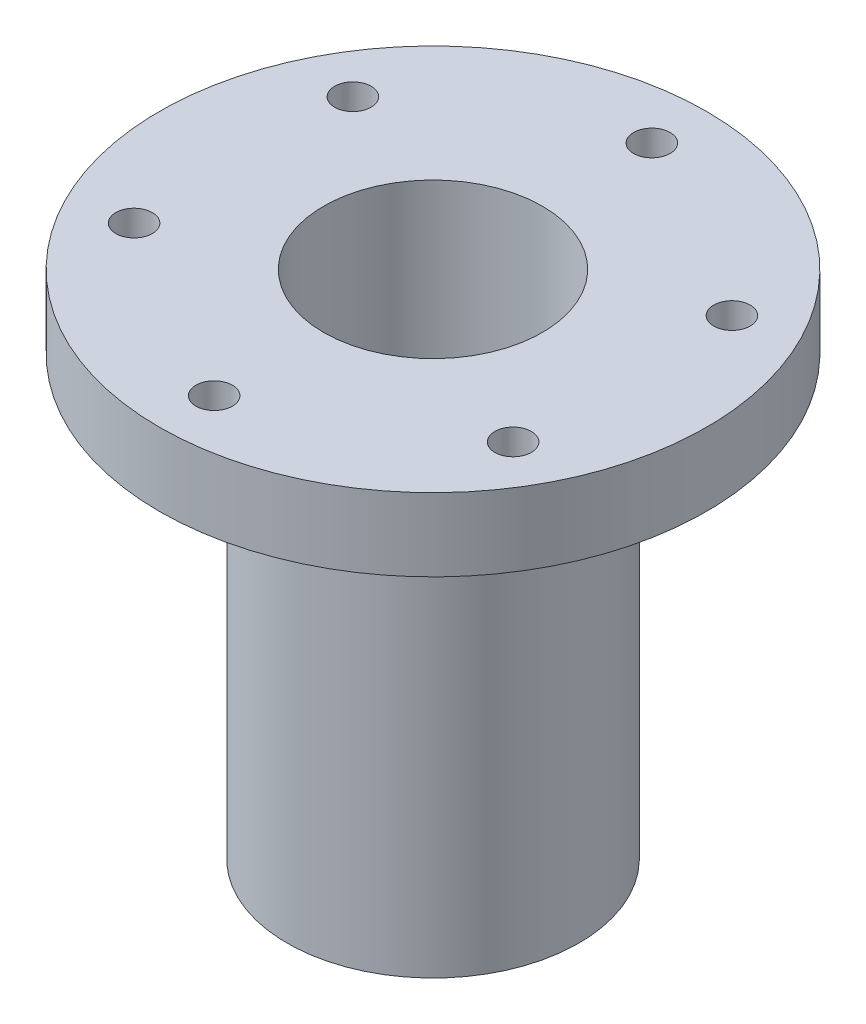
ISO-10303-21;
HEADER;
FILE_DESCRIPTION(('STEP AP214'),'2;1');
FILE_NAME('part.step','',(''),(''),'','','');
FILE_SCHEMA(('AUTOMOTIVE_DESIGN { 1 0 10303 214 1 1 1 1 }'));
ENDSEC;
DATA;
#1=APPLICATION_CONTEXT('core data for automotive mechanical design processes');
#2=APPLICATION_PROTOCOL_DEFINITION('international standard','automotive_design',2000,#1);
#3=PRODUCT_CONTEXT('',#1,'mechanical');
#4=PRODUCT('Part','Part','',(#3));
#5=PRODUCT_RELATED_PRODUCT_CATEGORY('part','',(#4));
#6=PRODUCT_DEFINITION_FORMATION('','',#4);
#7=PRODUCT_DEFINITION_CONTEXT('part definition',#1,'design');
#8=PRODUCT_DEFINITION('design','',#6,#7);
#9=PRODUCT_DEFINITION_SHAPE('','',#8);
#10=(LENGTH_UNIT() NAMED_UNIT(*) SI_UNIT(.MILLI.,.METRE.));
#11=(NAMED_UNIT(*) PLANE_ANGLE_UNIT() SI_UNIT($,.RADIAN.));
#12=(NAMED_UNIT(*) SI_UNIT($,.STERADIAN.) SOLID_ANGLE_UNIT());
#13=UNCERTAINTY_MEASURE_WITH_UNIT(LENGTH_MEASURE(1.E-05),#10,'distance_accuracy_value','');
#14=(GEOMETRIC_REPRESENTATION_CONTEXT(3) GLOBAL_UNCERTAINTY_ASSIGNED_CONTEXT((#13)) GLOBAL_UNIT_ASSIGNED_CONTEXT((#10,
#11,#12)) REPRESENTATION_CONTEXT('',''));
#15=CARTESIAN_POINT('',(0.,0.,0.));
#16=DIRECTION('',(0.,0.,1.));
#17=DIRECTION('',(1.,0.,0.));
#18=AXIS2_PLACEMENT_3D('',#15,#16,#17);
#19=CARTESIAN_POINT('',(-23.8125,6.90033333333332,0.));
#20=DIRECTION('',(0.,1.,0.));
#21=DIRECTION('',(0.,0.,1.));
#22=AXIS2_PLACEMENT_3D('',#19,#20,#21);
#23=PLANE('',#22);
#24=CARTESIAN_POINT('',(0.,6.90033333333332,-19.05));
#25=DIRECTION('',(0.,-1.,0.));
#26=DIRECTION('',(0.,0.,-1.));
#27=AXIS2_PLACEMENT_3D('',#24,#25,#26);
#28=CIRCLE('',#27,1.58749999999999);
#29=CARTESIAN_POINT('',(0.,6.90033333333332,-20.6375));
#30=VERTEX_POINT('',#29);
#31=EDGE_CURVE('E90',#30,#30,#28,.T.);
#32=ORIENTED_EDGE('',*,*,#31,.F.);
#33=EDGE_LOOP('',(#32));
#34=FACE_BOUND('',#33,.T.);
#35=CARTESIAN_POINT('',(-16.497783942094,6.90033333333332,-9.5250000000007));
#36=DIRECTION('',(0.,-1.,0.));
#37=DIRECTION('',(0.,0.,-1.));
#38=AXIS2_PLACEMENT_3D('',#35,#36,#37);
#39=CIRCLE('',#38,1.58749999999999);
#40=CARTESIAN_POINT('',(-16.497783942094,6.90033333333332,-11.1125000000007));
#41=VERTEX_POINT('',#40);
#42=EDGE_CURVE('E84',#41,#41,#39,.T.);
#43=ORIENTED_EDGE('',*,*,#42,.F.);
#44=EDGE_LOOP('',(#43));
#45=FACE_BOUND('',#44,.T.);
#46=CARTESIAN_POINT('',(-16.4977839420948,6.90033333333332,9.5249999999993));
#47=DIRECTION('',(0.,-1.,0.));
#48=DIRECTION('',(0.,0.,-1.));
#49=AXIS2_PLACEMENT_3D('',#46,#47,#48);
#50=CIRCLE('',#49,1.58749999999999);
#51=CARTESIAN_POINT('',(-16.4977839420948,6.90033333333332,7.93749999999931));
#52=VERTEX_POINT('',#51);
#53=EDGE_CURVE('E78',#52,#52,#50,.T.);
#54=ORIENTED_EDGE('',*,*,#53,.F.);
#55=EDGE_LOOP('',(#54));
#56=FACE_BOUND('',#55,.T.);
#57=CARTESIAN_POINT('',(-1.61963478964284E-12,6.90033333333332,19.05));
#58=DIRECTION('',(0.,-1.,0.));
#59=DIRECTION('',(0.,0.,-1.));
#60=AXIS2_PLACEMENT_3D('',#57,#58,#59);
#61=CIRCLE('',#60,1.58749999999999);
#62=CARTESIAN_POINT('',(-1.61963478964284E-12,6.90033333333332,17.4625));
#63=VERTEX_POINT('',#62);
#64=EDGE_CURVE('E72',#63,#63,#61,.T.);
#65=ORIENTED_EDGE('',*,*,#64,.F.);
#66=EDGE_LOOP('',(#65));
#67=FACE_BOUND('',#66,.T.);
#68=CARTESIAN_POINT('',(16.4977839420923,6.90033333333332,9.52500000000071));
#69=DIRECTION('',(0.,-1.,0.));
#70=DIRECTION('',(0.,0.,-1.));
#71=AXIS2_PLACEMENT_3D('',#68,#69,#70);
#72=CIRCLE('',#71,1.58749999999999);
#73=CARTESIAN_POINT('',(16.4977839420923,6.90033333333332,7.93750000000072));
#74=VERTEX_POINT('',#73);
#75=EDGE_CURVE('E66',#74,#74,#72,.T.);
#76=ORIENTED_EDGE('',*,*,#75,.F.);
#77=EDGE_LOOP('',(#76));
#78=FACE_BOUND('',#77,.T.);
#79=CARTESIAN_POINT('',(0.,6.90033333333332,0.));
#80=DIRECTION('',(0.,-1.,0.));
#81=DIRECTION('',(0.,0.,-1.));
#82=AXIS2_PLACEMENT_3D('',#79,#80,#81);
#83=CIRCLE('',#82,12.7);
#84=CARTESIAN_POINT('',(0.,6.90033333333332,-12.7));
#85=VERTEX_POINT('',#84);
#86=EDGE_CURVE('E51',#85,#85,#83,.T.);
#87=ORIENTED_EDGE('',*,*,#86,.F.);
#88=EDGE_LOOP('',(#87));
#89=FACE_BOUND('',#88,.T.);
#90=CARTESIAN_POINT('',(0.,6.90033333333332,0.));
#91=DIRECTION('',(0.,-1.,0.));
#92=DIRECTION('',(0.,0.,-1.));
#93=AXIS2_PLACEMENT_3D('',#90,#91,#92);
#94=CIRCLE('',#93,23.8125);
#95=CARTESIAN_POINT('',(0.,6.90033333333332,-23.8125));
#96=VERTEX_POINT('',#95);
#97=EDGE_CURVE('E46',#96,#96,#94,.T.);
#98=ORIENTED_EDGE('',*,*,#97,.T.);
#99=EDGE_LOOP('',(#98));
#100=FACE_BOUND('',#99,.T.);
#101=CARTESIAN_POINT('',(16.4977839420932,6.90033333333332,-9.5249999999993));
#102=DIRECTION('',(0.,-1.,0.));
#103=DIRECTION('',(0.,0.,-1.));
#104=AXIS2_PLACEMENT_3D('',#101,#102,#103);
#105=CIRCLE('',#104,1.58749999999999);
#106=CARTESIAN_POINT('',(16.4977839420932,6.90033333333332,-11.1124999999993));
#107=VERTEX_POINT('',#106);
#108=EDGE_CURVE('E60',#107,#107,#105,.T.);
#109=ORIENTED_EDGE('',*,*,#108,.F.);
#110=EDGE_LOOP('',(#109));
#111=FACE_BOUND('',#110,.T.);
#112=ADVANCED_FACE('F31',(#34,#45,#56,#67,#78,#89,#100,#111),#23,.F.);
#113=CARTESIAN_POINT('',(-12.7,-31.1996666666667,0.));
#114=DIRECTION('',(0.,1.,0.));
#115=DIRECTION('',(0.,0.,1.));
#116=AXIS2_PLACEMENT_3D('',#113,#114,#115);
#117=PLANE('',#116);
#118=CARTESIAN_POINT('',(0.,-31.1996666666667,0.));
#119=DIRECTION('',(0.,-1.,0.));
#120=DIRECTION('',(0.,0.,-1.));
#121=AXIS2_PLACEMENT_3D('',#118,#119,#120);
#122=CIRCLE('',#121,9.52499999999999);
#123=CARTESIAN_POINT('',(0.,-31.1996666666667,-9.52499999999999));
#124=VERTEX_POINT('',#123);
#125=EDGE_CURVE('E10',#124,#124,#122,.T.);
#126=ORIENTED_EDGE('',*,*,#125,.F.);
#127=EDGE_LOOP('',(#126));
#128=FACE_BOUND('',#127,.T.);
#129=CARTESIAN_POINT('',(0.,-31.1996666666667,0.));
#130=DIRECTION('',(0.,-1.,0.));
#131=DIRECTION('',(0.,0.,-1.));
#132=AXIS2_PLACEMENT_3D('',#129,#130,#131);
#133=CIRCLE('',#132,12.7);
#134=CARTESIAN_POINT('',(0.,-31.1996666666667,-12.7));
#135=VERTEX_POINT('',#134);
#136=EDGE_CURVE('E54',#135,#135,#133,.T.);
#137=ORIENTED_EDGE('',*,*,#136,.T.);
#138=EDGE_LOOP('',(#137));
#139=FACE_BOUND('',#138,.T.);
#140=ADVANCED_FACE('F33',(#128,#139),#117,.F.);
#141=CARTESIAN_POINT('',(0.,0.,0.));
#142=DIRECTION('',(0.,-1.,0.));
#143=DIRECTION('',(0.,0.,-1.));
#144=AXIS2_PLACEMENT_3D('',#141,#142,#143);
#145=CYLINDRICAL_SURFACE('',#144,9.52499999999999);
#146=CARTESIAN_POINT('',(0.,13.2503333333333,0.));
#147=DIRECTION('',(0.,-1.,0.));
#148=DIRECTION('',(0.,0.,-1.));
#149=AXIS2_PLACEMENT_3D('',#146,#147,#148);
#150=CIRCLE('',#149,9.525);
#151=CARTESIAN_POINT('',(0.,13.2503333333333,-9.525));
#152=VERTEX_POINT('',#151);
#153=EDGE_CURVE('E38',#152,#152,#150,.T.);
#154=ORIENTED_EDGE('',*,*,#153,.F.);
#155=EDGE_LOOP('',(#154));
#156=FACE_BOUND('',#155,.T.);
#157=ORIENTED_EDGE('',*,*,#125,.T.);
#158=EDGE_LOOP('',(#157));
#159=FACE_BOUND('',#158,.T.);
#160=ADVANCED_FACE('F137',(#156,#159),#145,.F.);
#161=CARTESIAN_POINT('',(-9.525,13.2503333333333,0.));
#162=DIRECTION('',(0.,-1.,0.));
#163=DIRECTION('',(0.,0.,-1.));
#164=AXIS2_PLACEMENT_3D('',#161,#162,#163);
#165=PLANE('',#164);
#166=CARTESIAN_POINT('',(0.,13.2503333333333,-19.05));
#167=DIRECTION('',(0.,-1.,0.));
#168=DIRECTION('',(0.,0.,-1.));
#169=AXIS2_PLACEMENT_3D('',#166,#167,#168);
#170=CIRCLE('',#169,1.58749999999999);
#171=CARTESIAN_POINT('',(0.,13.2503333333333,-20.6375));
#172=VERTEX_POINT('',#171);
#173=EDGE_CURVE('E87',#172,#172,#170,.T.);
#174=ORIENTED_EDGE('',*,*,#173,.T.);
#175=EDGE_LOOP('',(#174));
#176=FACE_BOUND('',#175,.T.);
#177=CARTESIAN_POINT('',(-16.497783942094,13.2503333333333,-9.5250000000007));
#178=DIRECTION('',(0.,-1.,0.));
#179=DIRECTION('',(0.,0.,-1.));
#180=AXIS2_PLACEMENT_3D('',#177,#178,#179);
#181=CIRCLE('',#180,1.58749999999999);
#182=CARTESIAN_POINT('',(-16.497783942094,13.2503333333333,-11.1125000000007));
#183=VERTEX_POINT('',#182);
#184=EDGE_CURVE('E81',#183,#183,#181,.T.);
#185=ORIENTED_EDGE('',*,*,#184,.T.);
#186=EDGE_LOOP('',(#185));
#187=FACE_BOUND('',#186,.T.);
#188=CARTESIAN_POINT('',(-16.4977839420948,13.2503333333333,9.5249999999993));
#189=DIRECTION('',(0.,-1.,0.));
#190=DIRECTION('',(0.,0.,-1.));
#191=AXIS2_PLACEMENT_3D('',#188,#189,#190);
#192=CIRCLE('',#191,1.58749999999999);
#193=CARTESIAN_POINT('',(-16.4977839420948,13.2503333333333,7.93749999999931));
#194=VERTEX_POINT('',#193);
#195=EDGE_CURVE('E75',#194,#194,#192,.T.);
#196=ORIENTED_EDGE('',*,*,#195,.T.);
#197=EDGE_LOOP('',(#196));
#198=FACE_BOUND('',#197,.T.);
#199=CARTESIAN_POINT('',(-1.61963478964284E-12,13.2503333333333,19.05));
#200=DIRECTION('',(0.,-1.,0.));
#201=DIRECTION('',(0.,0.,-1.));
#202=AXIS2_PLACEMENT_3D('',#199,#200,#201);
#203=CIRCLE('',#202,1.58749999999999);
#204=CARTESIAN_POINT('',(-1.61963478964284E-12,13.2503333333333,17.4625));
#205=VERTEX_POINT('',#204);
#206=EDGE_CURVE('E69',#205,#205,#203,.T.);
#207=ORIENTED_EDGE('',*,*,#206,.T.);
#208=EDGE_LOOP('',(#207));
#209=FACE_BOUND('',#208,.T.);
#210=CARTESIAN_POINT('',(16.4977839420923,13.2503333333333,9.52500000000071));
#211=DIRECTION('',(0.,-1.,0.));
#212=DIRECTION('',(0.,0.,-1.));
#213=AXIS2_PLACEMENT_3D('',#210,#211,#212);
#214=CIRCLE('',#213,1.58749999999999);
#215=CARTESIAN_POINT('',(16.4977839420923,13.2503333333333,7.93750000000072));
#216=VERTEX_POINT('',#215);
#217=EDGE_CURVE('E63',#216,#216,#214,.T.);
#218=ORIENTED_EDGE('',*,*,#217,.T.);
#219=EDGE_LOOP('',(#218));
#220=FACE_BOUND('',#219,.T.);
#221=CARTESIAN_POINT('',(16.4977839420932,13.2503333333333,-9.5249999999993));
#222=DIRECTION('',(0.,-1.,0.));
#223=DIRECTION('',(0.,0.,-1.));
#224=AXIS2_PLACEMENT_3D('',#221,#222,#223);
#225=CIRCLE('',#224,1.58749999999999);
#226=CARTESIAN_POINT('',(16.4977839420932,13.2503333333333,-11.1124999999993));
#227=VERTEX_POINT('',#226);
#228=EDGE_CURVE('E57',#227,#227,#225,.T.);
#229=ORIENTED_EDGE('',*,*,#228,.T.);
#230=EDGE_LOOP('',(#229));
#231=FACE_BOUND('',#230,.T.);
#232=CARTESIAN_POINT('',(0.,13.2503333333333,0.));
#233=DIRECTION('',(0.,-1.,0.));
#234=DIRECTION('',(0.,0.,-1.));
#235=AXIS2_PLACEMENT_3D('',#232,#233,#234);
#236=CIRCLE('',#235,23.8125);
#237=CARTESIAN_POINT('',(0.,13.2503333333333,-23.8125));
#238=VERTEX_POINT('',#237);
#239=EDGE_CURVE('E42',#238,#238,#236,.T.);
#240=ORIENTED_EDGE('',*,*,#239,.F.);
#241=EDGE_LOOP('',(#240));
#242=FACE_BOUND('',#241,.T.);
#243=ORIENTED_EDGE('',*,*,#153,.T.);
#244=EDGE_LOOP('',(#243));
#245=FACE_BOUND('',#244,.T.);
#246=ADVANCED_FACE('F134',(#176,#187,#198,#209,#220,#231,#242,#245),#165,.F.);
#247=CARTESIAN_POINT('',(0.,0.,0.));
#248=DIRECTION('',(0.,-1.,0.));
#249=DIRECTION('',(0.,0.,-1.));
#250=AXIS2_PLACEMENT_3D('',#247,#248,#249);
#251=CYLINDRICAL_SURFACE('',#250,23.8125);
#252=ORIENTED_EDGE('',*,*,#97,.F.);
#253=EDGE_LOOP('',(#252));
#254=FACE_BOUND('',#253,.T.);
#255=ORIENTED_EDGE('',*,*,#239,.T.);
#256=EDGE_LOOP('',(#255));
#257=FACE_BOUND('',#256,.T.);
#258=ADVANCED_FACE('F126',(#254,#257),#251,.T.);
#259=CARTESIAN_POINT('',(0.,0.,0.));
#260=DIRECTION('',(0.,-1.,0.));
#261=DIRECTION('',(0.,0.,-1.));
#262=AXIS2_PLACEMENT_3D('',#259,#260,#261);
#263=CYLINDRICAL_SURFACE('',#262,12.7);
#264=ORIENTED_EDGE('',*,*,#136,.F.);
#265=EDGE_LOOP('',(#264));
#266=FACE_BOUND('',#265,.T.);
#267=ORIENTED_EDGE('',*,*,#86,.T.);
#268=EDGE_LOOP('',(#267));
#269=FACE_BOUND('',#268,.T.);
#270=ADVANCED_FACE('F116',(#266,#269),#263,.T.);
#271=CARTESIAN_POINT('',(16.4977839420932,6.90033333333332,-9.5249999999993));
#272=DIRECTION('',(0.,-1.,0.));
#273=DIRECTION('',(0.,0.,-1.));
#274=AXIS2_PLACEMENT_3D('',#271,#272,#273);
#275=CYLINDRICAL_SURFACE('',#274,1.58749999999999);
#276=ORIENTED_EDGE('',*,*,#228,.F.);
#277=EDGE_LOOP('',(#276));
#278=FACE_BOUND('',#277,.T.);
#279=ORIENTED_EDGE('',*,*,#108,.T.);
#280=EDGE_LOOP('',(#279));
#281=FACE_BOUND('',#280,.T.);
#282=ADVANCED_FACE('F113',(#278,#281),#275,.F.);
#283=CARTESIAN_POINT('',(16.4977839420923,6.90033333333332,9.52500000000071));
#284=DIRECTION('',(0.,-1.,0.));
#285=DIRECTION('',(0.,0.,-1.));
#286=AXIS2_PLACEMENT_3D('',#283,#284,#285);
#287=CYLINDRICAL_SURFACE('',#286,1.58749999999999);
#288=ORIENTED_EDGE('',*,*,#217,.F.);
#289=EDGE_LOOP('',(#288));
#290=FACE_BOUND('',#289,.T.);
#291=ORIENTED_EDGE('',*,*,#75,.T.);
#292=EDGE_LOOP('',(#291));
#293=FACE_BOUND('',#292,.T.);
#294=ADVANCED_FACE('F115',(#290,#293),#287,.F.);
#295=CARTESIAN_POINT('',(-1.61963478964284E-12,6.90033333333332,19.05));
#296=DIRECTION('',(0.,-1.,0.));
#297=DIRECTION('',(0.,0.,-1.));
#298=AXIS2_PLACEMENT_3D('',#295,#296,#297);
#299=CYLINDRICAL_SURFACE('',#298,1.58749999999999);
#300=ORIENTED_EDGE('',*,*,#206,.F.);
#301=EDGE_LOOP('',(#300));
#302=FACE_BOUND('',#301,.T.);
#303=ORIENTED_EDGE('',*,*,#64,.T.);
#304=EDGE_LOOP('',(#303));
#305=FACE_BOUND('',#304,.T.);
#306=ADVANCED_FACE('F123',(#302,#305),#299,.F.);
#307=CARTESIAN_POINT('',(-16.4977839420948,6.90033333333332,9.5249999999993));
#308=DIRECTION('',(0.,-1.,0.));
#309=DIRECTION('',(0.,0.,-1.));
#310=AXIS2_PLACEMENT_3D('',#307,#308,#309);
#311=CYLINDRICAL_SURFACE('',#310,1.58749999999999);
#312=ORIENTED_EDGE('',*,*,#195,.F.);
#313=EDGE_LOOP('',(#312));
#314=FACE_BOUND('',#313,.T.);
#315=ORIENTED_EDGE('',*,*,#53,.T.);
#316=EDGE_LOOP('',(#315));
#317=FACE_BOUND('',#316,.T.);
#318=ADVANCED_FACE('F185',(#314,#317),#311,.F.);
#319=CARTESIAN_POINT('',(-16.497783942094,6.90033333333332,-9.5250000000007));
#320=DIRECTION('',(0.,-1.,0.));
#321=DIRECTION('',(0.,0.,-1.));
#322=AXIS2_PLACEMENT_3D('',#319,#320,#321);
#323=CYLINDRICAL_SURFACE('',#322,1.58749999999999);
#324=ORIENTED_EDGE('',*,*,#184,.F.);
#325=EDGE_LOOP('',(#324));
#326=FACE_BOUND('',#325,.T.);
#327=ORIENTED_EDGE('',*,*,#42,.T.);
#328=EDGE_LOOP('',(#327));
#329=FACE_BOUND('',#328,.T.);
#330=ADVANCED_FACE('F194',(#326,#329),#323,.F.);
#331=CARTESIAN_POINT('',(0.,6.90033333333332,-19.05));
#332=DIRECTION('',(0.,-1.,0.));
#333=DIRECTION('',(0.,0.,-1.));
#334=AXIS2_PLACEMENT_3D('',#331,#332,#333);
#335=CYLINDRICAL_SURFACE('',#334,1.58749999999999);
#336=ORIENTED_EDGE('',*,*,#173,.F.);
#337=EDGE_LOOP('',(#336));
#338=FACE_BOUND('',#337,.T.);
#339=ORIENTED_EDGE('',*,*,#31,.T.);
#340=EDGE_LOOP('',(#339));
#341=FACE_BOUND('',#340,.T.);
#342=ADVANCED_FACE('F94',(#338,#341),#335,.F.);
#343=CLOSED_SHELL('',(#112,#140,#160,#246,#258,#270,#282,#294,#306,#318,#330,#342));
#344=MANIFOLD_SOLID_BREP('B2',#343);
#345=ADVANCED_BREP_SHAPE_REPRESENTATION('',(#18,#344),#14);
#346=SHAPE_DEFINITION_REPRESENTATION(#9,#345);
ENDSEC;
END-ISO-10303-21;
